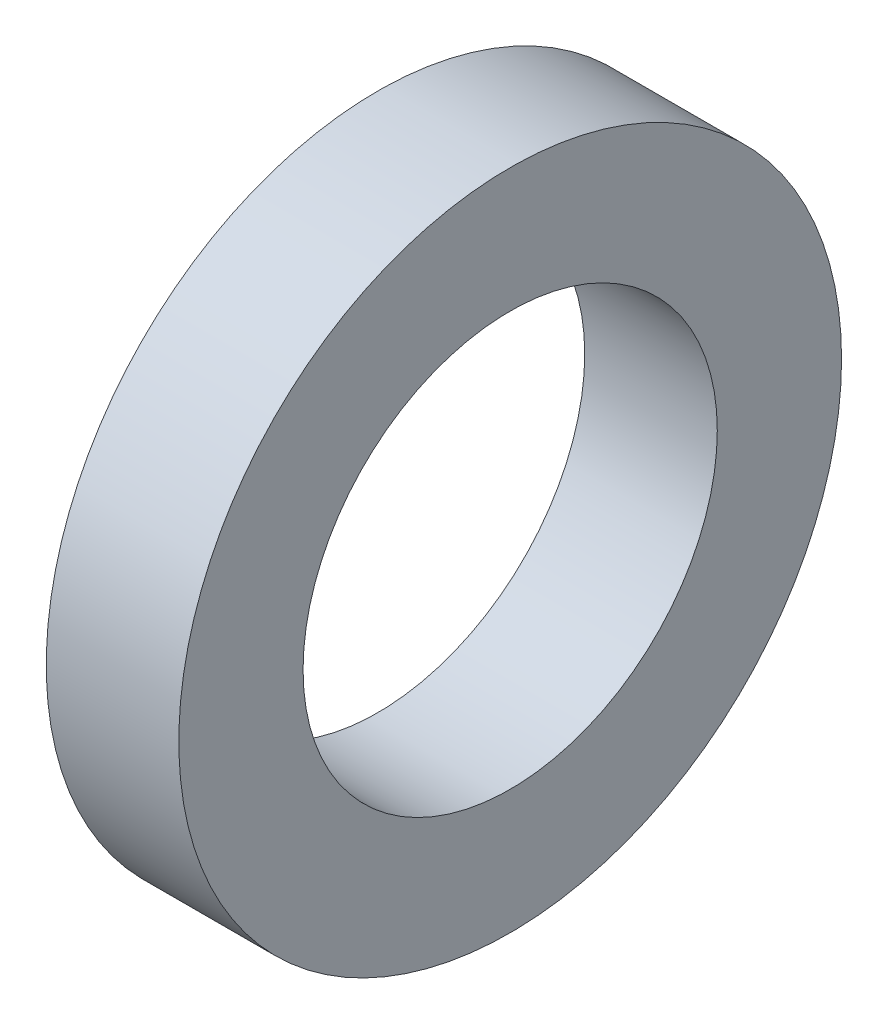
ISO-10303-21;
HEADER;
FILE_DESCRIPTION(('STEP AP214'),'2;1');
FILE_NAME('part.step','',(''),(''),'','','');
FILE_SCHEMA(('AUTOMOTIVE_DESIGN { 1 0 10303 214 1 1 1 1 }'));
ENDSEC;
DATA;
#1=APPLICATION_CONTEXT('core data for automotive mechanical design processes');
#2=APPLICATION_PROTOCOL_DEFINITION('international standard','automotive_design',2000,#1);
#3=PRODUCT_CONTEXT('',#1,'mechanical');
#4=PRODUCT('Part','Part','',(#3));
#5=PRODUCT_RELATED_PRODUCT_CATEGORY('part','',(#4));
#6=PRODUCT_DEFINITION_FORMATION('','',#4);
#7=PRODUCT_DEFINITION_CONTEXT('part definition',#1,'design');
#8=PRODUCT_DEFINITION('design','',#6,#7);
#9=PRODUCT_DEFINITION_SHAPE('','',#8);
#10=(LENGTH_UNIT() NAMED_UNIT(*) SI_UNIT(.MILLI.,.METRE.));
#11=(NAMED_UNIT(*) PLANE_ANGLE_UNIT() SI_UNIT($,.RADIAN.));
#12=(NAMED_UNIT(*) SI_UNIT($,.STERADIAN.) SOLID_ANGLE_UNIT());
#13=UNCERTAINTY_MEASURE_WITH_UNIT(LENGTH_MEASURE(1.E-05),#10,'distance_accuracy_value','');
#14=(GEOMETRIC_REPRESENTATION_CONTEXT(3) GLOBAL_UNCERTAINTY_ASSIGNED_CONTEXT((#13)) GLOBAL_UNIT_ASSIGNED_CONTEXT((#10,
#11,#12)) REPRESENTATION_CONTEXT('',''));
#15=CARTESIAN_POINT('',(0.,0.,0.));
#16=DIRECTION('',(0.,0.,1.));
#17=DIRECTION('',(1.,0.,0.));
#18=AXIS2_PLACEMENT_3D('',#15,#16,#17);
#19=CARTESIAN_POINT('',(5.08,0.,0.));
#20=DIRECTION('',(-1.,0.,0.));
#21=DIRECTION('',(0.,0.,1.));
#22=AXIS2_PLACEMENT_3D('',#19,#20,#21);
#23=CYLINDRICAL_SURFACE('',#22,12.7);
#24=CARTESIAN_POINT('',(5.08,0.,0.));
#25=DIRECTION('',(1.,0.,0.));
#26=DIRECTION('',(0.,0.,-1.));
#27=AXIS2_PLACEMENT_3D('',#24,#25,#26);
#28=CIRCLE('',#27,12.7);
#29=CARTESIAN_POINT('',(5.08,0.,-12.7));
#30=VERTEX_POINT('',#29);
#31=EDGE_CURVE('E10',#30,#30,#28,.T.);
#32=ORIENTED_EDGE('',*,*,#31,.F.);
#33=EDGE_LOOP('',(#32));
#34=FACE_BOUND('',#33,.T.);
#35=CARTESIAN_POINT('',(0.,0.,0.));
#36=DIRECTION('',(1.,0.,0.));
#37=DIRECTION('',(0.,0.,-1.));
#38=AXIS2_PLACEMENT_3D('',#35,#36,#37);
#39=CIRCLE('',#38,12.7);
#40=CARTESIAN_POINT('',(0.,0.,-12.7));
#41=VERTEX_POINT('',#40);
#42=EDGE_CURVE('E46',#41,#41,#39,.T.);
#43=ORIENTED_EDGE('',*,*,#42,.T.);
#44=EDGE_LOOP('',(#43));
#45=FACE_BOUND('',#44,.T.);
#46=ADVANCED_FACE('F43',(#34,#45),#23,.T.);
#47=CARTESIAN_POINT('',(5.08,0.,0.));
#48=DIRECTION('',(1.,0.,0.));
#49=DIRECTION('',(0.,0.,-1.));
#50=AXIS2_PLACEMENT_3D('',#47,#48,#49);
#51=PLANE('',#50);
#52=CARTESIAN_POINT('',(5.08,0.,0.));
#53=DIRECTION('',(1.,0.,0.));
#54=DIRECTION('',(0.,0.,-1.));
#55=AXIS2_PLACEMENT_3D('',#52,#53,#54);
#56=CIRCLE('',#55,7.93749999999999);
#57=CARTESIAN_POINT('',(5.08,0.,-7.93749999999999));
#58=VERTEX_POINT('',#57);
#59=EDGE_CURVE('E60',#58,#58,#56,.T.);
#60=ORIENTED_EDGE('',*,*,#59,.F.);
#61=EDGE_LOOP('',(#60));
#62=FACE_BOUND('',#61,.T.);
#63=ORIENTED_EDGE('',*,*,#31,.T.);
#64=EDGE_LOOP('',(#63));
#65=FACE_BOUND('',#64,.T.);
#66=ADVANCED_FACE('F67',(#62,#65),#51,.T.);
#67=CARTESIAN_POINT('',(0.,0.,0.));
#68=DIRECTION('',(1.,0.,0.));
#69=DIRECTION('',(0.,0.,-1.));
#70=AXIS2_PLACEMENT_3D('',#67,#68,#69);
#71=PLANE('',#70);
#72=CARTESIAN_POINT('',(0.,0.,0.));
#73=DIRECTION('',(1.,0.,0.));
#74=DIRECTION('',(0.,0.,-1.));
#75=AXIS2_PLACEMENT_3D('',#72,#73,#74);
#76=CIRCLE('',#75,7.9375);
#77=CARTESIAN_POINT('',(0.,0.,-7.9375));
#78=VERTEX_POINT('',#77);
#79=EDGE_CURVE('E55',#78,#78,#76,.T.);
#80=ORIENTED_EDGE('',*,*,#79,.T.);
#81=EDGE_LOOP('',(#80));
#82=FACE_BOUND('',#81,.T.);
#83=ORIENTED_EDGE('',*,*,#42,.F.);
#84=EDGE_LOOP('',(#83));
#85=FACE_BOUND('',#84,.T.);
#86=ADVANCED_FACE('F69',(#82,#85),#71,.F.);
#87=CARTESIAN_POINT('',(5.08,0.,0.));
#88=DIRECTION('',(1.,0.,0.));
#89=DIRECTION('',(0.,0.,-1.));
#90=AXIS2_PLACEMENT_3D('',#87,#88,#89);
#91=CYLINDRICAL_SURFACE('',#90,7.93749999999999);
#92=ORIENTED_EDGE('',*,*,#79,.F.);
#93=EDGE_LOOP('',(#92));
#94=FACE_BOUND('',#93,.T.);
#95=ORIENTED_EDGE('',*,*,#59,.T.);
#96=EDGE_LOOP('',(#95));
#97=FACE_BOUND('',#96,.T.);
#98=ADVANCED_FACE('F65',(#94,#97),#91,.F.);
#99=CLOSED_SHELL('',(#46,#66,#86,#98));
#100=MANIFOLD_SOLID_BREP('B2',#99);
#101=ADVANCED_BREP_SHAPE_REPRESENTATION('',(#18,#100),#14);
#102=SHAPE_DEFINITION_REPRESENTATION(#9,#101);
ENDSEC;
END-ISO-10303-21;
